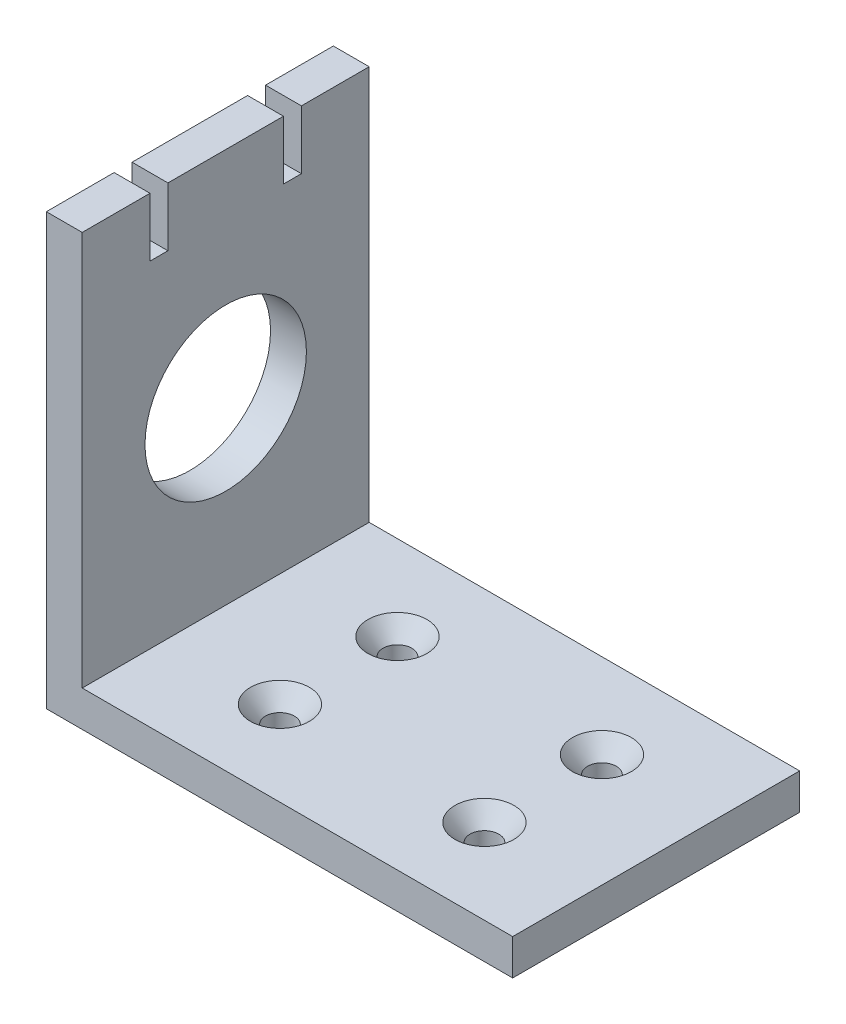
ISO-10303-21;
HEADER;
FILE_DESCRIPTION(('STEP AP214'),'2;1');
FILE_NAME('part.step','',(''),(''),'','','');
FILE_SCHEMA(('AUTOMOTIVE_DESIGN { 1 0 10303 214 1 1 1 1 }'));
ENDSEC;
DATA;
#1=APPLICATION_CONTEXT('core data for automotive mechanical design processes');
#2=APPLICATION_PROTOCOL_DEFINITION('international standard','automotive_design',2000,#1);
#3=PRODUCT_CONTEXT('',#1,'mechanical');
#4=PRODUCT('Part','Part','',(#3));
#5=PRODUCT_RELATED_PRODUCT_CATEGORY('part','',(#4));
#6=PRODUCT_DEFINITION_FORMATION('','',#4);
#7=PRODUCT_DEFINITION_CONTEXT('part definition',#1,'design');
#8=PRODUCT_DEFINITION('design','',#6,#7);
#9=PRODUCT_DEFINITION_SHAPE('','',#8);
#10=(LENGTH_UNIT() NAMED_UNIT(*) SI_UNIT(.MILLI.,.METRE.));
#11=(NAMED_UNIT(*) PLANE_ANGLE_UNIT() SI_UNIT($,.RADIAN.));
#12=(NAMED_UNIT(*) SI_UNIT($,.STERADIAN.) SOLID_ANGLE_UNIT());
#13=UNCERTAINTY_MEASURE_WITH_UNIT(LENGTH_MEASURE(1.E-05),#10,'distance_accuracy_value','');
#14=(GEOMETRIC_REPRESENTATION_CONTEXT(3) GLOBAL_UNCERTAINTY_ASSIGNED_CONTEXT((#13)) GLOBAL_UNIT_ASSIGNED_CONTEXT((#10,
#11,#12)) REPRESENTATION_CONTEXT('',''));
#15=CARTESIAN_POINT('',(0.,0.,0.));
#16=DIRECTION('',(0.,0.,1.));
#17=DIRECTION('',(1.,0.,0.));
#18=AXIS2_PLACEMENT_3D('',#15,#16,#17);
#19=CARTESIAN_POINT('',(6.35,76.2,0.));
#20=DIRECTION('',(0.,-1.,0.));
#21=DIRECTION('',(0.,0.,-1.));
#22=AXIS2_PLACEMENT_3D('',#19,#20,#21);
#23=PLANE('',#22);
#24=DIRECTION('',(0.,0.,1.));
#25=VECTOR('',#24,1.);
#26=CARTESIAN_POINT('',(6.35,76.2,0.));
#27=LINE('',#26,#25);
#28=CARTESIAN_POINT('',(6.35,76.2,-35.625));
#29=VERTEX_POINT('',#28);
#30=CARTESIAN_POINT('',(6.35,76.2,-15.175));
#31=VERTEX_POINT('',#30);
#32=EDGE_CURVE('E322',#29,#31,#27,.T.);
#33=ORIENTED_EDGE('',*,*,#32,.F.);
#34=DIRECTION('',(1.,0.,0.));
#35=VECTOR('',#34,1.);
#36=CARTESIAN_POINT('',(0.,76.2,-35.625));
#37=LINE('',#36,#35);
#38=CARTESIAN_POINT('',(0.,76.2,-35.625));
#39=VERTEX_POINT('',#38);
#40=EDGE_CURVE('E185',#39,#29,#37,.T.);
#41=ORIENTED_EDGE('',*,*,#40,.F.);
#42=DIRECTION('',(0.,0.,1.));
#43=VECTOR('',#42,1.);
#44=CARTESIAN_POINT('',(0.,76.2,0.));
#45=LINE('',#44,#43);
#46=CARTESIAN_POINT('',(0.,76.2,-15.175));
#47=VERTEX_POINT('',#46);
#48=EDGE_CURVE('E170',#39,#47,#45,.T.);
#49=ORIENTED_EDGE('',*,*,#48,.T.);
#50=DIRECTION('',(1.,0.,0.));
#51=VECTOR('',#50,1.);
#52=CARTESIAN_POINT('',(0.,76.2,-15.175));
#53=LINE('',#52,#51);
#54=EDGE_CURVE('E195',#47,#31,#53,.T.);
#55=ORIENTED_EDGE('',*,*,#54,.T.);
#56=EDGE_LOOP('',(#33,#41,#49,#55));
#57=FACE_BOUND('',#56,.T.);
#58=ADVANCED_FACE('F44',(#57),#23,.F.);
#59=CARTESIAN_POINT('',(0.,76.2,-50.8));
#60=VERTEX_POINT('',#59);
#61=CARTESIAN_POINT('',(0.,76.2,-38.8));
#62=VERTEX_POINT('',#61);
#63=EDGE_CURVE('E313',#60,#62,#45,.T.);
#64=ORIENTED_EDGE('',*,*,#63,.T.);
#65=DIRECTION('',(1.,0.,0.));
#66=VECTOR('',#65,1.);
#67=CARTESIAN_POINT('',(0.,76.2,-38.8));
#68=LINE('',#67,#66);
#69=CARTESIAN_POINT('',(6.35,76.2,-38.8));
#70=VERTEX_POINT('',#69);
#71=EDGE_CURVE('E189',#62,#70,#68,.T.);
#72=ORIENTED_EDGE('',*,*,#71,.T.);
#73=CARTESIAN_POINT('',(6.35,76.2,-50.8));
#74=VERTEX_POINT('',#73);
#75=EDGE_CURVE('E317',#74,#70,#27,.T.);
#76=ORIENTED_EDGE('',*,*,#75,.F.);
#77=DIRECTION('',(-1.,0.,0.));
#78=VECTOR('',#77,1.);
#79=CARTESIAN_POINT('',(6.35,76.2,-50.8));
#80=LINE('',#79,#78);
#81=EDGE_CURVE('E339',#74,#60,#80,.T.);
#82=ORIENTED_EDGE('',*,*,#81,.T.);
#83=EDGE_LOOP('',(#64,#72,#76,#82));
#84=FACE_BOUND('',#83,.T.);
#85=ADVANCED_FACE('F355',(#84),#23,.F.);
#86=CARTESIAN_POINT('',(6.35,0.,0.));
#87=DIRECTION('',(-1.,0.,0.));
#88=DIRECTION('',(0.,0.,1.));
#89=AXIS2_PLACEMENT_3D('',#86,#87,#88);
#90=PLANE('',#89);
#91=CARTESIAN_POINT('',(6.35,38.1,-25.4));
#92=DIRECTION('',(1.,0.,0.));
#93=DIRECTION('',(0.,0.,-1.));
#94=AXIS2_PLACEMENT_3D('',#91,#92,#93);
#95=CIRCLE('',#94,14.2875);
#96=CARTESIAN_POINT('',(6.35,38.1,-39.6875));
#97=VERTEX_POINT('',#96);
#98=EDGE_CURVE('E274',#97,#97,#95,.T.);
#99=ORIENTED_EDGE('',*,*,#98,.F.);
#100=EDGE_LOOP('',(#99));
#101=FACE_BOUND('',#100,.T.);
#102=DIRECTION('',(0.,0.,-1.));
#103=VECTOR('',#102,1.);
#104=CARTESIAN_POINT('',(6.35,65.8,-35.625));
#105=LINE('',#104,#103);
#106=CARTESIAN_POINT('',(6.35,65.8,-35.625));
#107=VERTEX_POINT('',#106);
#108=CARTESIAN_POINT('',(6.35,65.8,-38.8));
#109=VERTEX_POINT('',#108);
#110=EDGE_CURVE('E175',#107,#109,#105,.T.);
#111=ORIENTED_EDGE('',*,*,#110,.F.);
#112=DIRECTION('',(0.,-1.,0.));
#113=VECTOR('',#112,1.);
#114=CARTESIAN_POINT('',(6.35,76.2,-35.625));
#115=LINE('',#114,#113);
#116=EDGE_CURVE('E152',#29,#107,#115,.T.);
#117=ORIENTED_EDGE('',*,*,#116,.F.);
#118=ORIENTED_EDGE('',*,*,#32,.T.);
#119=DIRECTION('',(0.,1.,0.));
#120=VECTOR('',#119,1.);
#121=CARTESIAN_POINT('',(6.35,76.2,-15.175));
#122=LINE('',#121,#120);
#123=CARTESIAN_POINT('',(6.35,65.8,-15.175));
#124=VERTEX_POINT('',#123);
#125=EDGE_CURVE('E182',#124,#31,#122,.T.);
#126=ORIENTED_EDGE('',*,*,#125,.F.);
#127=DIRECTION('',(0.,0.,-1.));
#128=VECTOR('',#127,1.);
#129=CARTESIAN_POINT('',(6.35,65.8,-15.175));
#130=LINE('',#129,#128);
#131=CARTESIAN_POINT('',(6.35,65.8,-12.));
#132=VERTEX_POINT('',#131);
#133=EDGE_CURVE('E208',#132,#124,#130,.T.);
#134=ORIENTED_EDGE('',*,*,#133,.F.);
#135=DIRECTION('',(0.,-1.,0.));
#136=VECTOR('',#135,1.);
#137=CARTESIAN_POINT('',(6.35,76.2,-12.));
#138=LINE('',#137,#136);
#139=CARTESIAN_POINT('',(6.35,76.2,-12.));
#140=VERTEX_POINT('',#139);
#141=EDGE_CURVE('E212',#140,#132,#138,.T.);
#142=ORIENTED_EDGE('',*,*,#141,.F.);
#143=CARTESIAN_POINT('',(6.35,76.2,0.));
#144=VERTEX_POINT('',#143);
#145=EDGE_CURVE('E316',#140,#144,#27,.T.);
#146=ORIENTED_EDGE('',*,*,#145,.T.);
#147=DIRECTION('',(0.,-1.,0.));
#148=VECTOR('',#147,1.);
#149=CARTESIAN_POINT('',(6.35,0.,0.));
#150=LINE('',#149,#148);
#151=CARTESIAN_POINT('',(6.35,6.35,0.));
#152=VERTEX_POINT('',#151);
#153=EDGE_CURVE('E309',#144,#152,#150,.T.);
#154=ORIENTED_EDGE('',*,*,#153,.T.);
#155=DIRECTION('',(0.,0.,1.));
#156=VECTOR('',#155,1.);
#157=CARTESIAN_POINT('',(6.35,6.35,0.));
#158=LINE('',#157,#156);
#159=CARTESIAN_POINT('',(6.35,6.35,-50.8));
#160=VERTEX_POINT('',#159);
#161=EDGE_CURVE('E279',#160,#152,#158,.T.);
#162=ORIENTED_EDGE('',*,*,#161,.F.);
#163=DIRECTION('',(0.,1.,0.));
#164=VECTOR('',#163,1.);
#165=CARTESIAN_POINT('',(6.35,0.,-50.8));
#166=LINE('',#165,#164);
#167=EDGE_CURVE('E312',#160,#74,#166,.T.);
#168=ORIENTED_EDGE('',*,*,#167,.T.);
#169=ORIENTED_EDGE('',*,*,#75,.T.);
#170=DIRECTION('',(0.,1.,0.));
#171=VECTOR('',#170,1.);
#172=CARTESIAN_POINT('',(6.35,76.2,-38.8));
#173=LINE('',#172,#171);
#174=EDGE_CURVE('E172',#109,#70,#173,.T.);
#175=ORIENTED_EDGE('',*,*,#174,.F.);
#176=EDGE_LOOP('',(#111,#117,#118,#126,#134,#142,#146,#154,#162,#168,#169,#175));
#177=FACE_BOUND('',#176,.T.);
#178=ADVANCED_FACE('F378',(#101,#177),#90,.F.);
#179=CARTESIAN_POINT('',(6.35,0.,0.));
#180=DIRECTION('',(0.,0.,-1.));
#181=DIRECTION('',(0.,1.,0.));
#182=AXIS2_PLACEMENT_3D('',#179,#180,#181);
#183=PLANE('',#182);
#184=DIRECTION('',(0.,-1.,0.));
#185=VECTOR('',#184,1.);
#186=CARTESIAN_POINT('',(0.,0.,0.));
#187=LINE('',#186,#185);
#188=CARTESIAN_POINT('',(0.,76.2,0.));
#189=VERTEX_POINT('',#188);
#190=CARTESIAN_POINT('',(0.,0.,0.));
#191=VERTEX_POINT('',#190);
#192=EDGE_CURVE('E308',#189,#191,#187,.T.);
#193=ORIENTED_EDGE('',*,*,#192,.T.);
#194=DIRECTION('',(-1.,0.,0.));
#195=VECTOR('',#194,1.);
#196=CARTESIAN_POINT('',(6.35,0.,0.));
#197=LINE('',#196,#195);
#198=CARTESIAN_POINT('',(82.55,0.,0.));
#199=VERTEX_POINT('',#198);
#200=EDGE_CURVE('E11',#199,#191,#197,.T.);
#201=ORIENTED_EDGE('',*,*,#200,.F.);
#202=DIRECTION('',(0.,-1.,0.));
#203=VECTOR('',#202,1.);
#204=CARTESIAN_POINT('',(82.55,0.,0.));
#205=LINE('',#204,#203);
#206=CARTESIAN_POINT('',(82.55,6.35,0.));
#207=VERTEX_POINT('',#206);
#208=EDGE_CURVE('E283',#207,#199,#205,.T.);
#209=ORIENTED_EDGE('',*,*,#208,.F.);
#210=DIRECTION('',(-1.,0.,0.));
#211=VECTOR('',#210,1.);
#212=CARTESIAN_POINT('',(82.55,6.35,0.));
#213=LINE('',#212,#211);
#214=EDGE_CURVE('E297',#207,#152,#213,.T.);
#215=ORIENTED_EDGE('',*,*,#214,.T.);
#216=ORIENTED_EDGE('',*,*,#153,.F.);
#217=DIRECTION('',(-1.,0.,0.));
#218=VECTOR('',#217,1.);
#219=CARTESIAN_POINT('',(6.35,76.2,0.));
#220=LINE('',#219,#218);
#221=EDGE_CURVE('E321',#144,#189,#220,.T.);
#222=ORIENTED_EDGE('',*,*,#221,.T.);
#223=EDGE_LOOP('',(#193,#201,#209,#215,#216,#222));
#224=FACE_BOUND('',#223,.T.);
#225=ADVANCED_FACE('F46',(#224),#183,.F.);
#226=CARTESIAN_POINT('',(6.35,0.,0.));
#227=DIRECTION('',(0.,1.,0.));
#228=DIRECTION('',(0.,0.,1.));
#229=AXIS2_PLACEMENT_3D('',#226,#227,#228);
#230=PLANE('',#229);
#231=CARTESIAN_POINT('',(26.35,0.,-35.8));
#232=DIRECTION('',(0.,1.,0.));
#233=DIRECTION('',(0.,0.,1.));
#234=AXIS2_PLACEMENT_3D('',#231,#232,#233);
#235=CIRCLE('',#234,2.55269999999999);
#236=CARTESIAN_POINT('',(26.35,0.,-33.2473));
#237=VERTEX_POINT('',#236);
#238=EDGE_CURVE('E234',#237,#237,#235,.T.);
#239=ORIENTED_EDGE('',*,*,#238,.T.);
#240=EDGE_LOOP('',(#239));
#241=FACE_BOUND('',#240,.T.);
#242=CARTESIAN_POINT('',(62.55,0.,-35.8));
#243=DIRECTION('',(0.,1.,0.));
#244=DIRECTION('',(0.,0.,1.));
#245=AXIS2_PLACEMENT_3D('',#242,#243,#244);
#246=CIRCLE('',#245,2.55269999999999);
#247=CARTESIAN_POINT('',(62.55,0.,-33.2473));
#248=VERTEX_POINT('',#247);
#249=EDGE_CURVE('E246',#248,#248,#246,.T.);
#250=ORIENTED_EDGE('',*,*,#249,.T.);
#251=EDGE_LOOP('',(#250));
#252=FACE_BOUND('',#251,.T.);
#253=CARTESIAN_POINT('',(62.55,0.,-15.));
#254=DIRECTION('',(0.,1.,0.));
#255=DIRECTION('',(0.,0.,1.));
#256=AXIS2_PLACEMENT_3D('',#253,#254,#255);
#257=CIRCLE('',#256,2.55269999999999);
#258=CARTESIAN_POINT('',(62.55,0.,-12.4473));
#259=VERTEX_POINT('',#258);
#260=EDGE_CURVE('E258',#259,#259,#257,.T.);
#261=ORIENTED_EDGE('',*,*,#260,.T.);
#262=EDGE_LOOP('',(#261));
#263=FACE_BOUND('',#262,.T.);
#264=CARTESIAN_POINT('',(26.35,0.,-15.));
#265=DIRECTION('',(0.,1.,0.));
#266=DIRECTION('',(0.,0.,1.));
#267=AXIS2_PLACEMENT_3D('',#264,#265,#266);
#268=CIRCLE('',#267,2.55269999999999);
#269=CARTESIAN_POINT('',(26.35,0.,-12.4473));
#270=VERTEX_POINT('',#269);
#271=EDGE_CURVE('E270',#270,#270,#268,.T.);
#272=ORIENTED_EDGE('',*,*,#271,.T.);
#273=EDGE_LOOP('',(#272));
#274=FACE_BOUND('',#273,.T.);
#275=DIRECTION('',(0.,0.,-1.));
#276=VECTOR('',#275,1.);
#277=CARTESIAN_POINT('',(0.,0.,0.));
#278=LINE('',#277,#276);
#279=CARTESIAN_POINT('',(0.,0.,-50.8));
#280=VERTEX_POINT('',#279);
#281=EDGE_CURVE('E326',#191,#280,#278,.T.);
#282=ORIENTED_EDGE('',*,*,#281,.T.);
#283=DIRECTION('',(-1.,0.,0.));
#284=VECTOR('',#283,1.);
#285=CARTESIAN_POINT('',(6.35,0.,-50.8));
#286=LINE('',#285,#284);
#287=CARTESIAN_POINT('',(82.55,0.,-50.8));
#288=VERTEX_POINT('',#287);
#289=EDGE_CURVE('E53',#288,#280,#286,.T.);
#290=ORIENTED_EDGE('',*,*,#289,.F.);
#291=DIRECTION('',(0.,0.,-1.));
#292=VECTOR('',#291,1.);
#293=CARTESIAN_POINT('',(82.55,0.,0.));
#294=LINE('',#293,#292);
#295=EDGE_CURVE('E287',#199,#288,#294,.T.);
#296=ORIENTED_EDGE('',*,*,#295,.F.);
#297=ORIENTED_EDGE('',*,*,#200,.T.);
#298=EDGE_LOOP('',(#282,#290,#296,#297));
#299=FACE_BOUND('',#298,.T.);
#300=ADVANCED_FACE('F366',(#241,#252,#263,#274,#299),#230,.F.);
#301=CARTESIAN_POINT('',(6.35,0.,-50.8));
#302=DIRECTION('',(0.,0.,1.));
#303=DIRECTION('',(0.,-1.,0.));
#304=AXIS2_PLACEMENT_3D('',#301,#302,#303);
#305=PLANE('',#304);
#306=DIRECTION('',(0.,1.,0.));
#307=VECTOR('',#306,1.);
#308=CARTESIAN_POINT('',(0.,0.,-50.8));
#309=LINE('',#308,#307);
#310=EDGE_CURVE('E329',#280,#60,#309,.T.);
#311=ORIENTED_EDGE('',*,*,#310,.T.);
#312=ORIENTED_EDGE('',*,*,#81,.F.);
#313=ORIENTED_EDGE('',*,*,#167,.F.);
#314=DIRECTION('',(-1.,0.,0.));
#315=VECTOR('',#314,1.);
#316=CARTESIAN_POINT('',(82.55,6.35,-50.8));
#317=LINE('',#316,#315);
#318=CARTESIAN_POINT('',(82.55,6.35,-50.8));
#319=VERTEX_POINT('',#318);
#320=EDGE_CURVE('E304',#319,#160,#317,.T.);
#321=ORIENTED_EDGE('',*,*,#320,.F.);
#322=DIRECTION('',(0.,1.,0.));
#323=VECTOR('',#322,1.);
#324=CARTESIAN_POINT('',(82.55,0.,-50.8));
#325=LINE('',#324,#323);
#326=EDGE_CURVE('E291',#288,#319,#325,.T.);
#327=ORIENTED_EDGE('',*,*,#326,.F.);
#328=ORIENTED_EDGE('',*,*,#289,.T.);
#329=EDGE_LOOP('',(#311,#312,#313,#321,#327,#328));
#330=FACE_BOUND('',#329,.T.);
#331=ADVANCED_FACE('F347',(#330),#305,.F.);
#332=ORIENTED_EDGE('',*,*,#145,.F.);
#333=DIRECTION('',(1.,0.,0.));
#334=VECTOR('',#333,1.);
#335=CARTESIAN_POINT('',(0.,76.2,-12.));
#336=LINE('',#335,#334);
#337=CARTESIAN_POINT('',(0.,76.2,-12.));
#338=VERTEX_POINT('',#337);
#339=EDGE_CURVE('E199',#338,#140,#336,.T.);
#340=ORIENTED_EDGE('',*,*,#339,.F.);
#341=EDGE_CURVE('E332',#338,#189,#45,.T.);
#342=ORIENTED_EDGE('',*,*,#341,.T.);
#343=ORIENTED_EDGE('',*,*,#221,.F.);
#344=EDGE_LOOP('',(#332,#340,#342,#343));
#345=FACE_BOUND('',#344,.T.);
#346=ADVANCED_FACE('F393',(#345),#23,.F.);
#347=CARTESIAN_POINT('',(0.,0.,0.));
#348=DIRECTION('',(-1.,0.,0.));
#349=DIRECTION('',(0.,0.,1.));
#350=AXIS2_PLACEMENT_3D('',#347,#348,#349);
#351=PLANE('',#350);
#352=DIRECTION('',(0.,-1.,0.));
#353=VECTOR('',#352,1.);
#354=CARTESIAN_POINT('',(0.,76.2,-35.625));
#355=LINE('',#354,#353);
#356=CARTESIAN_POINT('',(0.,65.8,-35.625));
#357=VERTEX_POINT('',#356);
#358=EDGE_CURVE('E149',#39,#357,#355,.T.);
#359=ORIENTED_EDGE('',*,*,#358,.T.);
#360=DIRECTION('',(0.,0.,-1.));
#361=VECTOR('',#360,1.);
#362=CARTESIAN_POINT('',(0.,65.8,-35.625));
#363=LINE('',#362,#361);
#364=CARTESIAN_POINT('',(0.,65.8,-38.8));
#365=VERTEX_POINT('',#364);
#366=EDGE_CURVE('E160',#357,#365,#363,.T.);
#367=ORIENTED_EDGE('',*,*,#366,.T.);
#368=DIRECTION('',(0.,1.,0.));
#369=VECTOR('',#368,1.);
#370=CARTESIAN_POINT('',(0.,76.2,-38.8));
#371=LINE('',#370,#369);
#372=EDGE_CURVE('E60',#365,#62,#371,.T.);
#373=ORIENTED_EDGE('',*,*,#372,.T.);
#374=ORIENTED_EDGE('',*,*,#63,.F.);
#375=ORIENTED_EDGE('',*,*,#310,.F.);
#376=ORIENTED_EDGE('',*,*,#281,.F.);
#377=ORIENTED_EDGE('',*,*,#192,.F.);
#378=ORIENTED_EDGE('',*,*,#341,.F.);
#379=DIRECTION('',(0.,-1.,0.));
#380=VECTOR('',#379,1.);
#381=CARTESIAN_POINT('',(0.,76.2,-12.));
#382=LINE('',#381,#380);
#383=CARTESIAN_POINT('',(0.,65.8,-12.));
#384=VERTEX_POINT('',#383);
#385=EDGE_CURVE('E221',#338,#384,#382,.T.);
#386=ORIENTED_EDGE('',*,*,#385,.T.);
#387=DIRECTION('',(0.,0.,-1.));
#388=VECTOR('',#387,1.);
#389=CARTESIAN_POINT('',(0.,65.8,-15.175));
#390=LINE('',#389,#388);
#391=CARTESIAN_POINT('',(0.,65.8,-15.175));
#392=VERTEX_POINT('',#391);
#393=EDGE_CURVE('E68',#384,#392,#390,.T.);
#394=ORIENTED_EDGE('',*,*,#393,.T.);
#395=DIRECTION('',(0.,1.,0.));
#396=VECTOR('',#395,1.);
#397=CARTESIAN_POINT('',(0.,76.2,-15.175));
#398=LINE('',#397,#396);
#399=EDGE_CURVE('E213',#392,#47,#398,.T.);
#400=ORIENTED_EDGE('',*,*,#399,.T.);
#401=ORIENTED_EDGE('',*,*,#48,.F.);
#402=EDGE_LOOP('',(#359,#367,#373,#374,#375,#376,#377,#378,#386,#394,#400,#401));
#403=FACE_BOUND('',#402,.T.);
#404=CARTESIAN_POINT('',(0.,38.1,-25.4));
#405=DIRECTION('',(1.,0.,0.));
#406=DIRECTION('',(0.,0.,-1.));
#407=AXIS2_PLACEMENT_3D('',#404,#405,#406);
#408=CIRCLE('',#407,14.2875);
#409=CARTESIAN_POINT('',(0.,38.1,-39.6875));
#410=VERTEX_POINT('',#409);
#411=EDGE_CURVE('E275',#410,#410,#408,.T.);
#412=ORIENTED_EDGE('',*,*,#411,.T.);
#413=EDGE_LOOP('',(#412));
#414=FACE_BOUND('',#413,.T.);
#415=ADVANCED_FACE('F166',(#403,#414),#351,.T.);
#416=CARTESIAN_POINT('',(82.55,6.35,0.));
#417=DIRECTION('',(0.,-1.,0.));
#418=DIRECTION('',(0.,0.,-1.));
#419=AXIS2_PLACEMENT_3D('',#416,#417,#418);
#420=PLANE('',#419);
#421=CARTESIAN_POINT('',(26.35,6.35,-35.8));
#422=DIRECTION('',(0.,1.,0.));
#423=DIRECTION('',(0.,0.,1.));
#424=AXIS2_PLACEMENT_3D('',#421,#422,#423);
#425=CIRCLE('',#424,5.2197);
#426=CARTESIAN_POINT('',(26.35,6.35,-30.5803));
#427=VERTEX_POINT('',#426);
#428=EDGE_CURVE('E188',#427,#427,#425,.T.);
#429=ORIENTED_EDGE('',*,*,#428,.F.);
#430=EDGE_LOOP('',(#429));
#431=FACE_BOUND('',#430,.T.);
#432=CARTESIAN_POINT('',(62.55,6.35,-35.8));
#433=DIRECTION('',(0.,1.,0.));
#434=DIRECTION('',(0.,0.,1.));
#435=AXIS2_PLACEMENT_3D('',#432,#433,#434);
#436=CIRCLE('',#435,5.21969999999999);
#437=CARTESIAN_POINT('',(62.55,6.35,-30.5803));
#438=VERTEX_POINT('',#437);
#439=EDGE_CURVE('E238',#438,#438,#436,.T.);
#440=ORIENTED_EDGE('',*,*,#439,.F.);
#441=EDGE_LOOP('',(#440));
#442=FACE_BOUND('',#441,.T.);
#443=CARTESIAN_POINT('',(62.55,6.35,-15.));
#444=DIRECTION('',(0.,1.,0.));
#445=DIRECTION('',(0.,0.,1.));
#446=AXIS2_PLACEMENT_3D('',#443,#444,#445);
#447=CIRCLE('',#446,5.21969999999999);
#448=CARTESIAN_POINT('',(62.55,6.35,-9.78030000000001));
#449=VERTEX_POINT('',#448);
#450=EDGE_CURVE('E250',#449,#449,#447,.T.);
#451=ORIENTED_EDGE('',*,*,#450,.F.);
#452=EDGE_LOOP('',(#451));
#453=FACE_BOUND('',#452,.T.);
#454=CARTESIAN_POINT('',(26.35,6.35,-15.));
#455=DIRECTION('',(0.,1.,0.));
#456=DIRECTION('',(0.,0.,1.));
#457=AXIS2_PLACEMENT_3D('',#454,#455,#456);
#458=CIRCLE('',#457,5.2197);
#459=CARTESIAN_POINT('',(26.35,6.35,-9.7803));
#460=VERTEX_POINT('',#459);
#461=EDGE_CURVE('E262',#460,#460,#458,.T.);
#462=ORIENTED_EDGE('',*,*,#461,.F.);
#463=EDGE_LOOP('',(#462));
#464=FACE_BOUND('',#463,.T.);
#465=ORIENTED_EDGE('',*,*,#161,.T.);
#466=ORIENTED_EDGE('',*,*,#214,.F.);
#467=DIRECTION('',(0.,0.,1.));
#468=VECTOR('',#467,1.);
#469=CARTESIAN_POINT('',(82.55,6.35,0.));
#470=LINE('',#469,#468);
#471=EDGE_CURVE('E294',#319,#207,#470,.T.);
#472=ORIENTED_EDGE('',*,*,#471,.F.);
#473=ORIENTED_EDGE('',*,*,#320,.T.);
#474=EDGE_LOOP('',(#465,#466,#472,#473));
#475=FACE_BOUND('',#474,.T.);
#476=ADVANCED_FACE('F361',(#431,#442,#453,#464,#475),#420,.F.);
#477=CARTESIAN_POINT('',(82.55,0.,0.));
#478=DIRECTION('',(-1.,0.,0.));
#479=DIRECTION('',(0.,0.,1.));
#480=AXIS2_PLACEMENT_3D('',#477,#478,#479);
#481=PLANE('',#480);
#482=ORIENTED_EDGE('',*,*,#208,.T.);
#483=ORIENTED_EDGE('',*,*,#295,.T.);
#484=ORIENTED_EDGE('',*,*,#326,.T.);
#485=ORIENTED_EDGE('',*,*,#471,.T.);
#486=EDGE_LOOP('',(#482,#483,#484,#485));
#487=FACE_BOUND('',#486,.T.);
#488=ADVANCED_FACE('F365',(#487),#481,.F.);
#489=CARTESIAN_POINT('',(0.,38.1,-25.4));
#490=DIRECTION('',(1.,0.,0.));
#491=DIRECTION('',(0.,0.,-1.));
#492=AXIS2_PLACEMENT_3D('',#489,#490,#491);
#493=CYLINDRICAL_SURFACE('',#492,14.2875);
#494=ORIENTED_EDGE('',*,*,#411,.F.);
#495=EDGE_LOOP('',(#494));
#496=FACE_BOUND('',#495,.T.);
#497=ORIENTED_EDGE('',*,*,#98,.T.);
#498=EDGE_LOOP('',(#497));
#499=FACE_BOUND('',#498,.T.);
#500=ADVANCED_FACE('F456',(#496,#499),#493,.F.);
#501=CARTESIAN_POINT('',(26.35,6.35,-15.));
#502=DIRECTION('',(0.,1.,0.));
#503=DIRECTION('',(0.,0.,1.));
#504=AXIS2_PLACEMENT_3D('',#501,#502,#503);
#505=CYLINDRICAL_SURFACE('',#504,2.55269999999999);
#506=ORIENTED_EDGE('',*,*,#271,.F.);
#507=EDGE_LOOP('',(#506));
#508=FACE_BOUND('',#507,.T.);
#509=CARTESIAN_POINT('',(26.35,3.28196745794157,-15.));
#510=DIRECTION('',(0.,1.,0.));
#511=DIRECTION('',(0.,0.,1.));
#512=AXIS2_PLACEMENT_3D('',#509,#510,#511);
#513=CIRCLE('',#512,2.5527);
#514=CARTESIAN_POINT('',(26.35,3.28196745794157,-12.4473));
#515=VERTEX_POINT('',#514);
#516=EDGE_CURVE('E266',#515,#515,#513,.T.);
#517=ORIENTED_EDGE('',*,*,#516,.T.);
#518=EDGE_LOOP('',(#517));
#519=FACE_BOUND('',#518,.T.);
#520=ADVANCED_FACE('F452',(#508,#519),#505,.F.);
#521=CARTESIAN_POINT('',(26.35,6.35,-15.));
#522=DIRECTION('',(0.,1.,0.));
#523=DIRECTION('',(0.,0.,1.));
#524=AXIS2_PLACEMENT_3D('',#521,#522,#523);
#525=CONICAL_SURFACE('',#524,5.2197,0.715584993317675);
#526=ORIENTED_EDGE('',*,*,#516,.F.);
#527=EDGE_LOOP('',(#526));
#528=FACE_BOUND('',#527,.T.);
#529=ORIENTED_EDGE('',*,*,#461,.T.);
#530=EDGE_LOOP('',(#529));
#531=FACE_BOUND('',#530,.T.);
#532=ADVANCED_FACE('F448',(#528,#531),#525,.F.);
#533=CARTESIAN_POINT('',(62.55,6.35,-15.));
#534=DIRECTION('',(0.,1.,0.));
#535=DIRECTION('',(0.,0.,1.));
#536=AXIS2_PLACEMENT_3D('',#533,#534,#535);
#537=CYLINDRICAL_SURFACE('',#536,2.5527);
#538=ORIENTED_EDGE('',*,*,#260,.F.);
#539=EDGE_LOOP('',(#538));
#540=FACE_BOUND('',#539,.T.);
#541=CARTESIAN_POINT('',(62.55,3.28196745794157,-15.));
#542=DIRECTION('',(0.,1.,0.));
#543=DIRECTION('',(0.,0.,1.));
#544=AXIS2_PLACEMENT_3D('',#541,#542,#543);
#545=CIRCLE('',#544,2.55270000000001);
#546=CARTESIAN_POINT('',(62.55,3.28196745794157,-12.4473));
#547=VERTEX_POINT('',#546);
#548=EDGE_CURVE('E254',#547,#547,#545,.T.);
#549=ORIENTED_EDGE('',*,*,#548,.T.);
#550=EDGE_LOOP('',(#549));
#551=FACE_BOUND('',#550,.T.);
#552=ADVANCED_FACE('F444',(#540,#551),#537,.F.);
#553=CARTESIAN_POINT('',(62.55,6.35,-15.));
#554=DIRECTION('',(0.,1.,0.));
#555=DIRECTION('',(0.,0.,1.));
#556=AXIS2_PLACEMENT_3D('',#553,#554,#555);
#557=CONICAL_SURFACE('',#556,5.21969999999999,0.715584993317673);
#558=ORIENTED_EDGE('',*,*,#548,.F.);
#559=EDGE_LOOP('',(#558));
#560=FACE_BOUND('',#559,.T.);
#561=ORIENTED_EDGE('',*,*,#450,.T.);
#562=EDGE_LOOP('',(#561));
#563=FACE_BOUND('',#562,.T.);
#564=ADVANCED_FACE('F440',(#560,#563),#557,.F.);
#565=CARTESIAN_POINT('',(62.55,6.35,-35.8));
#566=DIRECTION('',(0.,1.,0.));
#567=DIRECTION('',(0.,0.,1.));
#568=AXIS2_PLACEMENT_3D('',#565,#566,#567);
#569=CYLINDRICAL_SURFACE('',#568,2.5527);
#570=ORIENTED_EDGE('',*,*,#249,.F.);
#571=EDGE_LOOP('',(#570));
#572=FACE_BOUND('',#571,.T.);
#573=CARTESIAN_POINT('',(62.55,3.28196745794157,-35.8));
#574=DIRECTION('',(0.,1.,0.));
#575=DIRECTION('',(0.,0.,1.));
#576=AXIS2_PLACEMENT_3D('',#573,#574,#575);
#577=CIRCLE('',#576,2.55270000000001);
#578=CARTESIAN_POINT('',(62.55,3.28196745794157,-33.2473));
#579=VERTEX_POINT('',#578);
#580=EDGE_CURVE('E242',#579,#579,#577,.T.);
#581=ORIENTED_EDGE('',*,*,#580,.T.);
#582=EDGE_LOOP('',(#581));
#583=FACE_BOUND('',#582,.T.);
#584=ADVANCED_FACE('F436',(#572,#583),#569,.F.);
#585=CARTESIAN_POINT('',(62.55,6.35,-35.8));
#586=DIRECTION('',(0.,1.,0.));
#587=DIRECTION('',(0.,0.,1.));
#588=AXIS2_PLACEMENT_3D('',#585,#586,#587);
#589=CONICAL_SURFACE('',#588,5.21969999999999,0.715584993317673);
#590=ORIENTED_EDGE('',*,*,#580,.F.);
#591=EDGE_LOOP('',(#590));
#592=FACE_BOUND('',#591,.T.);
#593=ORIENTED_EDGE('',*,*,#439,.T.);
#594=EDGE_LOOP('',(#593));
#595=FACE_BOUND('',#594,.T.);
#596=ADVANCED_FACE('F432',(#592,#595),#589,.F.);
#597=CARTESIAN_POINT('',(26.35,6.35,-35.8));
#598=DIRECTION('',(0.,1.,0.));
#599=DIRECTION('',(0.,0.,1.));
#600=AXIS2_PLACEMENT_3D('',#597,#598,#599);
#601=CYLINDRICAL_SURFACE('',#600,2.55269999999999);
#602=ORIENTED_EDGE('',*,*,#238,.F.);
#603=EDGE_LOOP('',(#602));
#604=FACE_BOUND('',#603,.T.);
#605=CARTESIAN_POINT('',(26.35,3.28196745794157,-35.8));
#606=DIRECTION('',(0.,1.,0.));
#607=DIRECTION('',(0.,0.,1.));
#608=AXIS2_PLACEMENT_3D('',#605,#606,#607);
#609=CIRCLE('',#608,2.5527);
#610=CARTESIAN_POINT('',(26.35,3.28196745794157,-33.2473));
#611=VERTEX_POINT('',#610);
#612=EDGE_CURVE('E230',#611,#611,#609,.T.);
#613=ORIENTED_EDGE('',*,*,#612,.T.);
#614=EDGE_LOOP('',(#613));
#615=FACE_BOUND('',#614,.T.);
#616=ADVANCED_FACE('F424',(#604,#615),#601,.F.);
#617=CARTESIAN_POINT('',(26.35,6.35,-35.8));
#618=DIRECTION('',(0.,1.,0.));
#619=DIRECTION('',(0.,0.,1.));
#620=AXIS2_PLACEMENT_3D('',#617,#618,#619);
#621=CONICAL_SURFACE('',#620,5.2197,0.715584993317675);
#622=ORIENTED_EDGE('',*,*,#612,.F.);
#623=EDGE_LOOP('',(#622));
#624=FACE_BOUND('',#623,.T.);
#625=ORIENTED_EDGE('',*,*,#428,.T.);
#626=EDGE_LOOP('',(#625));
#627=FACE_BOUND('',#626,.T.);
#628=ADVANCED_FACE('F417',(#624,#627),#621,.F.);
#629=CARTESIAN_POINT('',(0.,76.2,-15.175));
#630=DIRECTION('',(0.,0.,-1.));
#631=DIRECTION('',(-1.,0.,0.));
#632=AXIS2_PLACEMENT_3D('',#629,#630,#631);
#633=PLANE('',#632);
#634=ORIENTED_EDGE('',*,*,#125,.T.);
#635=ORIENTED_EDGE('',*,*,#54,.F.);
#636=ORIENTED_EDGE('',*,*,#399,.F.);
#637=DIRECTION('',(1.,0.,0.));
#638=VECTOR('',#637,1.);
#639=CARTESIAN_POINT('',(0.,65.8,-15.175));
#640=LINE('',#639,#638);
#641=EDGE_CURVE('E205',#392,#124,#640,.T.);
#642=ORIENTED_EDGE('',*,*,#641,.T.);
#643=EDGE_LOOP('',(#634,#635,#636,#642));
#644=FACE_BOUND('',#643,.T.);
#645=ADVANCED_FACE('F415',(#644),#633,.F.);
#646=CARTESIAN_POINT('',(0.,65.8,-15.175));
#647=DIRECTION('',(0.,-1.,0.));
#648=DIRECTION('',(0.,0.,-1.));
#649=AXIS2_PLACEMENT_3D('',#646,#647,#648);
#650=PLANE('',#649);
#651=ORIENTED_EDGE('',*,*,#133,.T.);
#652=ORIENTED_EDGE('',*,*,#641,.F.);
#653=ORIENTED_EDGE('',*,*,#393,.F.);
#654=DIRECTION('',(1.,0.,0.));
#655=VECTOR('',#654,1.);
#656=CARTESIAN_POINT('',(0.,65.8,-12.));
#657=LINE('',#656,#655);
#658=EDGE_CURVE('E202',#384,#132,#657,.T.);
#659=ORIENTED_EDGE('',*,*,#658,.T.);
#660=EDGE_LOOP('',(#651,#652,#653,#659));
#661=FACE_BOUND('',#660,.T.);
#662=ADVANCED_FACE('F412',(#661),#650,.F.);
#663=CARTESIAN_POINT('',(0.,76.2,-12.));
#664=DIRECTION('',(0.,0.,1.));
#665=DIRECTION('',(1.,0.,0.));
#666=AXIS2_PLACEMENT_3D('',#663,#664,#665);
#667=PLANE('',#666);
#668=ORIENTED_EDGE('',*,*,#141,.T.);
#669=ORIENTED_EDGE('',*,*,#658,.F.);
#670=ORIENTED_EDGE('',*,*,#385,.F.);
#671=ORIENTED_EDGE('',*,*,#339,.T.);
#672=EDGE_LOOP('',(#668,#669,#670,#671));
#673=FACE_BOUND('',#672,.T.);
#674=ADVANCED_FACE('F389',(#673),#667,.F.);
#675=CARTESIAN_POINT('',(0.,76.2,-35.625));
#676=DIRECTION('',(0.,0.,1.));
#677=DIRECTION('',(1.,0.,0.));
#678=AXIS2_PLACEMENT_3D('',#675,#676,#677);
#679=PLANE('',#678);
#680=ORIENTED_EDGE('',*,*,#116,.T.);
#681=DIRECTION('',(1.,0.,0.));
#682=VECTOR('',#681,1.);
#683=CARTESIAN_POINT('',(0.,65.8,-35.625));
#684=LINE('',#683,#682);
#685=EDGE_CURVE('E145',#357,#107,#684,.T.);
#686=ORIENTED_EDGE('',*,*,#685,.F.);
#687=ORIENTED_EDGE('',*,*,#358,.F.);
#688=ORIENTED_EDGE('',*,*,#40,.T.);
#689=EDGE_LOOP('',(#680,#686,#687,#688));
#690=FACE_BOUND('',#689,.T.);
#691=ADVANCED_FACE('F147',(#690),#679,.F.);
#692=CARTESIAN_POINT('',(0.,76.2,-38.8));
#693=DIRECTION('',(0.,0.,-1.));
#694=DIRECTION('',(-1.,0.,0.));
#695=AXIS2_PLACEMENT_3D('',#692,#693,#694);
#696=PLANE('',#695);
#697=ORIENTED_EDGE('',*,*,#174,.T.);
#698=ORIENTED_EDGE('',*,*,#71,.F.);
#699=ORIENTED_EDGE('',*,*,#372,.F.);
#700=DIRECTION('',(1.,0.,0.));
#701=VECTOR('',#700,1.);
#702=CARTESIAN_POINT('',(0.,65.8,-38.8));
#703=LINE('',#702,#701);
#704=EDGE_CURVE('E157',#365,#109,#703,.T.);
#705=ORIENTED_EDGE('',*,*,#704,.T.);
#706=EDGE_LOOP('',(#697,#698,#699,#705));
#707=FACE_BOUND('',#706,.T.);
#708=ADVANCED_FACE('F381',(#707),#696,.F.);
#709=CARTESIAN_POINT('',(0.,65.8,-35.625));
#710=DIRECTION('',(0.,-1.,0.));
#711=DIRECTION('',(0.,0.,-1.));
#712=AXIS2_PLACEMENT_3D('',#709,#710,#711);
#713=PLANE('',#712);
#714=ORIENTED_EDGE('',*,*,#110,.T.);
#715=ORIENTED_EDGE('',*,*,#704,.F.);
#716=ORIENTED_EDGE('',*,*,#366,.F.);
#717=ORIENTED_EDGE('',*,*,#685,.T.);
#718=EDGE_LOOP('',(#714,#715,#716,#717));
#719=FACE_BOUND('',#718,.T.);
#720=ADVANCED_FACE('F161',(#719),#713,.F.);
#721=CLOSED_SHELL('',(#58,#85,#178,#225,#300,#331,#346,#415,#476,#488,#500,#520,#532,#552,#564,
#584,#596,#616,#628,#645,#662,#674,#691,#708,#720));
#722=MANIFOLD_SOLID_BREP('B2',#721);
#723=ADVANCED_BREP_SHAPE_REPRESENTATION('',(#18,#722),#14);
#724=SHAPE_DEFINITION_REPRESENTATION(#9,#723);
ENDSEC;
END-ISO-10303-21;
